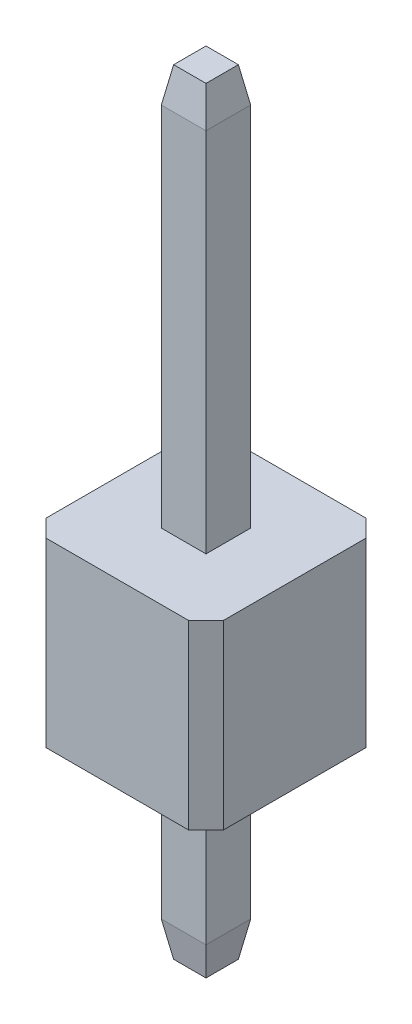
ISO-10303-21;
HEADER;
FILE_DESCRIPTION(('STEP AP214'),'2;1');
FILE_NAME('part.step','',(''),(''),'','','');
FILE_SCHEMA(('AUTOMOTIVE_DESIGN { 1 0 10303 214 1 1 1 1 }'));
ENDSEC;
DATA;
#1=APPLICATION_CONTEXT('core data for automotive mechanical design processes');
#2=APPLICATION_PROTOCOL_DEFINITION('international standard','automotive_design',2000,#1);
#3=PRODUCT_CONTEXT('',#1,'mechanical');
#4=PRODUCT('Part','Part','',(#3));
#5=PRODUCT_RELATED_PRODUCT_CATEGORY('part','',(#4));
#6=PRODUCT_DEFINITION_FORMATION('','',#4);
#7=PRODUCT_DEFINITION_CONTEXT('part definition',#1,'design');
#8=PRODUCT_DEFINITION('design','',#6,#7);
#9=PRODUCT_DEFINITION_SHAPE('','',#8);
#10=(LENGTH_UNIT() NAMED_UNIT(*) SI_UNIT(.MILLI.,.METRE.));
#11=(NAMED_UNIT(*) PLANE_ANGLE_UNIT() SI_UNIT($,.RADIAN.));
#12=(NAMED_UNIT(*) SI_UNIT($,.STERADIAN.) SOLID_ANGLE_UNIT());
#13=UNCERTAINTY_MEASURE_WITH_UNIT(LENGTH_MEASURE(1.E-05),#10,'distance_accuracy_value','');
#14=(GEOMETRIC_REPRESENTATION_CONTEXT(3) GLOBAL_UNCERTAINTY_ASSIGNED_CONTEXT((#13)) GLOBAL_UNIT_ASSIGNED_CONTEXT((#10,
#11,#12)) REPRESENTATION_CONTEXT('',''));
#15=CARTESIAN_POINT('',(0.,0.,0.));
#16=DIRECTION('',(0.,0.,1.));
#17=DIRECTION('',(1.,0.,0.));
#18=AXIS2_PLACEMENT_3D('',#15,#16,#17);
#19=CARTESIAN_POINT('',(0.,2.6,1.27));
#20=DIRECTION('',(0.,0.,-1.));
#21=DIRECTION('',(-1.,0.,0.));
#22=AXIS2_PLACEMENT_3D('',#19,#20,#21);
#23=PLANE('',#22);
#24=DIRECTION('',(1.,0.,0.));
#25=VECTOR('',#24,1.);
#26=CARTESIAN_POINT('',(0.,2.6,1.27));
#27=LINE('',#26,#25);
#28=CARTESIAN_POINT('',(-1.02,2.6,1.27));
#29=VERTEX_POINT('',#28);
#30=CARTESIAN_POINT('',(1.02,2.6,1.27));
#31=VERTEX_POINT('',#30);
#32=EDGE_CURVE('E205',#29,#31,#27,.T.);
#33=ORIENTED_EDGE('',*,*,#32,.F.);
#34=DIRECTION('',(0.,-1.,0.));
#35=VECTOR('',#34,1.);
#36=CARTESIAN_POINT('',(-1.02,0.,1.27));
#37=LINE('',#36,#35);
#38=CARTESIAN_POINT('',(-1.02,0.,1.27));
#39=VERTEX_POINT('',#38);
#40=EDGE_CURVE('E261',#29,#39,#37,.T.);
#41=ORIENTED_EDGE('',*,*,#40,.T.);
#42=DIRECTION('',(1.,0.,0.));
#43=VECTOR('',#42,1.);
#44=CARTESIAN_POINT('',(0.,0.,1.27));
#45=LINE('',#44,#43);
#46=CARTESIAN_POINT('',(1.02,0.,1.27));
#47=VERTEX_POINT('',#46);
#48=EDGE_CURVE('E204',#39,#47,#45,.T.);
#49=ORIENTED_EDGE('',*,*,#48,.T.);
#50=DIRECTION('',(0.,1.,0.));
#51=VECTOR('',#50,1.);
#52=CARTESIAN_POINT('',(1.02,2.6,1.27));
#53=LINE('',#52,#51);
#54=EDGE_CURVE('E259',#47,#31,#53,.T.);
#55=ORIENTED_EDGE('',*,*,#54,.T.);
#56=EDGE_LOOP('',(#33,#41,#49,#55));
#57=FACE_BOUND('',#56,.T.);
#58=ADVANCED_FACE('F17',(#57),#23,.F.);
#59=CARTESIAN_POINT('',(1.27,2.6,0.));
#60=DIRECTION('',(-1.,0.,0.));
#61=DIRECTION('',(0.,0.,1.));
#62=AXIS2_PLACEMENT_3D('',#59,#60,#61);
#63=PLANE('',#62);
#64=DIRECTION('',(0.,0.,-1.));
#65=VECTOR('',#64,1.);
#66=CARTESIAN_POINT('',(1.27,0.,0.));
#67=LINE('',#66,#65);
#68=CARTESIAN_POINT('',(1.27,0.,1.02));
#69=VERTEX_POINT('',#68);
#70=CARTESIAN_POINT('',(1.27,0.,-1.02));
#71=VERTEX_POINT('',#70);
#72=EDGE_CURVE('E221',#69,#71,#67,.T.);
#73=ORIENTED_EDGE('',*,*,#72,.T.);
#74=DIRECTION('',(0.,1.,0.));
#75=VECTOR('',#74,1.);
#76=CARTESIAN_POINT('',(1.27,2.6,-1.02));
#77=LINE('',#76,#75);
#78=CARTESIAN_POINT('',(1.27,2.6,-1.02));
#79=VERTEX_POINT('',#78);
#80=EDGE_CURVE('E244',#71,#79,#77,.T.);
#81=ORIENTED_EDGE('',*,*,#80,.T.);
#82=DIRECTION('',(0.,0.,-1.));
#83=VECTOR('',#82,1.);
#84=CARTESIAN_POINT('',(1.27,2.6,0.));
#85=LINE('',#84,#83);
#86=CARTESIAN_POINT('',(1.27,2.6,1.02));
#87=VERTEX_POINT('',#86);
#88=EDGE_CURVE('E208',#87,#79,#85,.T.);
#89=ORIENTED_EDGE('',*,*,#88,.F.);
#90=DIRECTION('',(0.,-1.,0.));
#91=VECTOR('',#90,1.);
#92=CARTESIAN_POINT('',(1.27,2.6,1.02));
#93=LINE('',#92,#91);
#94=EDGE_CURVE('E241',#87,#69,#93,.T.);
#95=ORIENTED_EDGE('',*,*,#94,.T.);
#96=EDGE_LOOP('',(#73,#81,#89,#95));
#97=FACE_BOUND('',#96,.T.);
#98=ADVANCED_FACE('F383',(#97),#63,.F.);
#99=CARTESIAN_POINT('',(0.,2.6,-1.27));
#100=DIRECTION('',(0.,0.,-1.));
#101=DIRECTION('',(-1.,0.,0.));
#102=AXIS2_PLACEMENT_3D('',#99,#100,#101);
#103=PLANE('',#102);
#104=DIRECTION('',(1.,0.,0.));
#105=VECTOR('',#104,1.);
#106=CARTESIAN_POINT('',(0.,2.6,-1.27));
#107=LINE('',#106,#105);
#108=CARTESIAN_POINT('',(-1.02,2.6,-1.27));
#109=VERTEX_POINT('',#108);
#110=CARTESIAN_POINT('',(1.02,2.6,-1.27));
#111=VERTEX_POINT('',#110);
#112=EDGE_CURVE('E212',#109,#111,#107,.T.);
#113=ORIENTED_EDGE('',*,*,#112,.T.);
#114=DIRECTION('',(0.,-1.,0.));
#115=VECTOR('',#114,1.);
#116=CARTESIAN_POINT('',(1.02,0.,-1.27));
#117=LINE('',#116,#115);
#118=CARTESIAN_POINT('',(1.02,0.,-1.27));
#119=VERTEX_POINT('',#118);
#120=EDGE_CURVE('E230',#111,#119,#117,.T.);
#121=ORIENTED_EDGE('',*,*,#120,.T.);
#122=DIRECTION('',(1.,0.,0.));
#123=VECTOR('',#122,1.);
#124=CARTESIAN_POINT('',(0.,0.,-1.27));
#125=LINE('',#124,#123);
#126=CARTESIAN_POINT('',(-1.02,0.,-1.27));
#127=VERTEX_POINT('',#126);
#128=EDGE_CURVE('E224',#127,#119,#125,.T.);
#129=ORIENTED_EDGE('',*,*,#128,.F.);
#130=DIRECTION('',(0.,1.,0.));
#131=VECTOR('',#130,1.);
#132=CARTESIAN_POINT('',(-1.02,2.6,-1.27));
#133=LINE('',#132,#131);
#134=EDGE_CURVE('E218',#127,#109,#133,.T.);
#135=ORIENTED_EDGE('',*,*,#134,.T.);
#136=EDGE_LOOP('',(#113,#121,#129,#135));
#137=FACE_BOUND('',#136,.T.);
#138=ADVANCED_FACE('F389',(#137),#103,.T.);
#139=CARTESIAN_POINT('',(-1.27,2.6,0.));
#140=DIRECTION('',(-1.,0.,0.));
#141=DIRECTION('',(0.,0.,1.));
#142=AXIS2_PLACEMENT_3D('',#139,#140,#141);
#143=PLANE('',#142);
#144=DIRECTION('',(0.,0.,-1.));
#145=VECTOR('',#144,1.);
#146=CARTESIAN_POINT('',(-1.27,2.6,0.));
#147=LINE('',#146,#145);
#148=CARTESIAN_POINT('',(-1.27,2.6,1.02));
#149=VERTEX_POINT('',#148);
#150=CARTESIAN_POINT('',(-1.27,2.6,-1.02));
#151=VERTEX_POINT('',#150);
#152=EDGE_CURVE('E215',#149,#151,#147,.T.);
#153=ORIENTED_EDGE('',*,*,#152,.T.);
#154=DIRECTION('',(0.,-1.,0.));
#155=VECTOR('',#154,1.);
#156=CARTESIAN_POINT('',(-1.27,2.6,-1.02));
#157=LINE('',#156,#155);
#158=CARTESIAN_POINT('',(-1.27,0.,-1.02));
#159=VERTEX_POINT('',#158);
#160=EDGE_CURVE('E256',#151,#159,#157,.T.);
#161=ORIENTED_EDGE('',*,*,#160,.T.);
#162=DIRECTION('',(0.,0.,-1.));
#163=VECTOR('',#162,1.);
#164=CARTESIAN_POINT('',(-1.27,0.,0.));
#165=LINE('',#164,#163);
#166=CARTESIAN_POINT('',(-1.27,0.,1.02));
#167=VERTEX_POINT('',#166);
#168=EDGE_CURVE('E209',#167,#159,#165,.T.);
#169=ORIENTED_EDGE('',*,*,#168,.F.);
#170=DIRECTION('',(0.,1.,0.));
#171=VECTOR('',#170,1.);
#172=CARTESIAN_POINT('',(-1.27,2.6,1.02));
#173=LINE('',#172,#171);
#174=EDGE_CURVE('E254',#167,#149,#173,.T.);
#175=ORIENTED_EDGE('',*,*,#174,.T.);
#176=EDGE_LOOP('',(#153,#161,#169,#175));
#177=FACE_BOUND('',#176,.T.);
#178=ADVANCED_FACE('F429',(#177),#143,.T.);
#179=CARTESIAN_POINT('',(0.,2.6,0.));
#180=DIRECTION('',(0.,1.,0.));
#181=DIRECTION('',(0.,0.,1.));
#182=AXIS2_PLACEMENT_3D('',#179,#180,#181);
#183=PLANE('',#182);
#184=DIRECTION('',(1.,0.,0.));
#185=VECTOR('',#184,1.);
#186=CARTESIAN_POINT('',(0.,2.6,0.32));
#187=LINE('',#186,#185);
#188=CARTESIAN_POINT('',(-0.32,2.6,0.32));
#189=VERTEX_POINT('',#188);
#190=CARTESIAN_POINT('',(0.32,2.6,0.32));
#191=VERTEX_POINT('',#190);
#192=EDGE_CURVE('E32',#189,#191,#187,.T.);
#193=ORIENTED_EDGE('',*,*,#192,.F.);
#194=DIRECTION('',(0.,0.,-1.));
#195=VECTOR('',#194,1.);
#196=CARTESIAN_POINT('',(-0.32,2.6,0.));
#197=LINE('',#196,#195);
#198=CARTESIAN_POINT('',(-0.32,2.6,-0.32));
#199=VERTEX_POINT('',#198);
#200=EDGE_CURVE('E36',#189,#199,#197,.T.);
#201=ORIENTED_EDGE('',*,*,#200,.T.);
#202=DIRECTION('',(1.,0.,0.));
#203=VECTOR('',#202,1.);
#204=CARTESIAN_POINT('',(0.,2.6,-0.32));
#205=LINE('',#204,#203);
#206=CARTESIAN_POINT('',(0.32,2.6,-0.32));
#207=VERTEX_POINT('',#206);
#208=EDGE_CURVE('E199',#199,#207,#205,.T.);
#209=ORIENTED_EDGE('',*,*,#208,.T.);
#210=DIRECTION('',(0.,0.,-1.));
#211=VECTOR('',#210,1.);
#212=CARTESIAN_POINT('',(0.32,2.6,0.));
#213=LINE('',#212,#211);
#214=EDGE_CURVE('E196',#191,#207,#213,.T.);
#215=ORIENTED_EDGE('',*,*,#214,.F.);
#216=EDGE_LOOP('',(#193,#201,#209,#215));
#217=FACE_BOUND('',#216,.T.);
#218=ORIENTED_EDGE('',*,*,#88,.T.);
#219=DIRECTION('',(-0.707106781186546,0.,-0.707106781186549));
#220=VECTOR('',#219,1.);
#221=CARTESIAN_POINT('',(1.145,2.6,-1.145));
#222=LINE('',#221,#220);
#223=EDGE_CURVE('E252',#79,#111,#222,.T.);
#224=ORIENTED_EDGE('',*,*,#223,.T.);
#225=ORIENTED_EDGE('',*,*,#112,.F.);
#226=DIRECTION('',(0.707106781186549,0.,-0.707106781186546));
#227=VECTOR('',#226,1.);
#228=CARTESIAN_POINT('',(-1.145,2.6,-1.145));
#229=LINE('',#228,#227);
#230=EDGE_CURVE('E250',#109,#151,#229,.F.);
#231=ORIENTED_EDGE('',*,*,#230,.T.);
#232=ORIENTED_EDGE('',*,*,#152,.F.);
#233=DIRECTION('',(0.707106781186546,0.,0.707106781186549));
#234=VECTOR('',#233,1.);
#235=CARTESIAN_POINT('',(-1.145,2.6,1.145));
#236=LINE('',#235,#234);
#237=EDGE_CURVE('E248',#149,#29,#236,.T.);
#238=ORIENTED_EDGE('',*,*,#237,.T.);
#239=ORIENTED_EDGE('',*,*,#32,.T.);
#240=DIRECTION('',(-0.707106781186549,0.,0.707106781186546));
#241=VECTOR('',#240,1.);
#242=CARTESIAN_POINT('',(1.145,2.6,1.145));
#243=LINE('',#242,#241);
#244=EDGE_CURVE('E246',#31,#87,#243,.F.);
#245=ORIENTED_EDGE('',*,*,#244,.T.);
#246=EDGE_LOOP('',(#218,#224,#225,#231,#232,#238,#239,#245));
#247=FACE_BOUND('',#246,.T.);
#248=ADVANCED_FACE('F363',(#217,#247),#183,.T.);
#249=CARTESIAN_POINT('',(0.,0.,0.));
#250=DIRECTION('',(0.,1.,0.));
#251=DIRECTION('',(0.,0.,1.));
#252=AXIS2_PLACEMENT_3D('',#249,#250,#251);
#253=PLANE('',#252);
#254=DIRECTION('',(0.,0.,-1.));
#255=VECTOR('',#254,1.);
#256=CARTESIAN_POINT('',(-0.32,0.,0.));
#257=LINE('',#256,#255);
#258=CARTESIAN_POINT('',(-0.32,0.,0.32));
#259=VERTEX_POINT('',#258);
#260=CARTESIAN_POINT('',(-0.32,0.,-0.32));
#261=VERTEX_POINT('',#260);
#262=EDGE_CURVE('E25',#259,#261,#257,.T.);
#263=ORIENTED_EDGE('',*,*,#262,.F.);
#264=DIRECTION('',(1.,0.,0.));
#265=VECTOR('',#264,1.);
#266=CARTESIAN_POINT('',(0.,0.,0.32));
#267=LINE('',#266,#265);
#268=CARTESIAN_POINT('',(0.32,0.,0.32));
#269=VERTEX_POINT('',#268);
#270=EDGE_CURVE('E11',#259,#269,#267,.T.);
#271=ORIENTED_EDGE('',*,*,#270,.T.);
#272=DIRECTION('',(0.,0.,-1.));
#273=VECTOR('',#272,1.);
#274=CARTESIAN_POINT('',(0.32,0.,0.));
#275=LINE('',#274,#273);
#276=CARTESIAN_POINT('',(0.32,0.,-0.32));
#277=VERTEX_POINT('',#276);
#278=EDGE_CURVE('E264',#269,#277,#275,.T.);
#279=ORIENTED_EDGE('',*,*,#278,.T.);
#280=DIRECTION('',(1.,0.,0.));
#281=VECTOR('',#280,1.);
#282=CARTESIAN_POINT('',(0.,0.,-0.32));
#283=LINE('',#282,#281);
#284=EDGE_CURVE('E267',#261,#277,#283,.T.);
#285=ORIENTED_EDGE('',*,*,#284,.F.);
#286=EDGE_LOOP('',(#263,#271,#279,#285));
#287=FACE_BOUND('',#286,.T.);
#288=ORIENTED_EDGE('',*,*,#128,.T.);
#289=DIRECTION('',(0.707106781186546,0.,0.707106781186549));
#290=VECTOR('',#289,1.);
#291=CARTESIAN_POINT('',(1.02,0.,-1.27));
#292=LINE('',#291,#290);
#293=EDGE_CURVE('E239',#119,#71,#292,.T.);
#294=ORIENTED_EDGE('',*,*,#293,.T.);
#295=ORIENTED_EDGE('',*,*,#72,.F.);
#296=DIRECTION('',(0.707106781186549,0.,-0.707106781186546));
#297=VECTOR('',#296,1.);
#298=CARTESIAN_POINT('',(1.27,0.,1.02));
#299=LINE('',#298,#297);
#300=EDGE_CURVE('E233',#69,#47,#299,.F.);
#301=ORIENTED_EDGE('',*,*,#300,.T.);
#302=ORIENTED_EDGE('',*,*,#48,.F.);
#303=DIRECTION('',(-0.707106781186546,0.,-0.707106781186549));
#304=VECTOR('',#303,1.);
#305=CARTESIAN_POINT('',(-1.02,0.,1.27));
#306=LINE('',#305,#304);
#307=EDGE_CURVE('E235',#39,#167,#306,.T.);
#308=ORIENTED_EDGE('',*,*,#307,.T.);
#309=ORIENTED_EDGE('',*,*,#168,.T.);
#310=DIRECTION('',(-0.707106781186549,0.,0.707106781186546));
#311=VECTOR('',#310,1.);
#312=CARTESIAN_POINT('',(-1.27,0.,-1.02));
#313=LINE('',#312,#311);
#314=EDGE_CURVE('E237',#159,#127,#313,.F.);
#315=ORIENTED_EDGE('',*,*,#314,.T.);
#316=EDGE_LOOP('',(#288,#294,#295,#301,#302,#308,#309,#315));
#317=FACE_BOUND('',#316,.T.);
#318=ADVANCED_FACE('F288',(#287,#317),#253,.F.);
#319=CARTESIAN_POINT('',(1.02,2.6,-1.27));
#320=DIRECTION('',(0.707106781186549,0.,-0.707106781186546));
#321=DIRECTION('',(0.,1.,0.));
#322=AXIS2_PLACEMENT_3D('',#319,#320,#321);
#323=PLANE('',#322);
#324=ORIENTED_EDGE('',*,*,#223,.F.);
#325=ORIENTED_EDGE('',*,*,#80,.F.);
#326=ORIENTED_EDGE('',*,*,#293,.F.);
#327=ORIENTED_EDGE('',*,*,#120,.F.);
#328=EDGE_LOOP('',(#324,#325,#326,#327));
#329=FACE_BOUND('',#328,.T.);
#330=ADVANCED_FACE('F395',(#329),#323,.T.);
#331=CARTESIAN_POINT('',(-1.27,2.6,-1.02));
#332=DIRECTION('',(0.707106781186546,0.,0.707106781186549));
#333=DIRECTION('',(0.,-1.,0.));
#334=AXIS2_PLACEMENT_3D('',#331,#332,#333);
#335=PLANE('',#334);
#336=ORIENTED_EDGE('',*,*,#230,.F.);
#337=ORIENTED_EDGE('',*,*,#134,.F.);
#338=ORIENTED_EDGE('',*,*,#314,.F.);
#339=ORIENTED_EDGE('',*,*,#160,.F.);
#340=EDGE_LOOP('',(#336,#337,#338,#339));
#341=FACE_BOUND('',#340,.T.);
#342=ADVANCED_FACE('F398',(#341),#335,.F.);
#343=CARTESIAN_POINT('',(-1.02,2.6,1.27));
#344=DIRECTION('',(-0.707106781186549,0.,0.707106781186546));
#345=DIRECTION('',(0.,1.,0.));
#346=AXIS2_PLACEMENT_3D('',#343,#344,#345);
#347=PLANE('',#346);
#348=ORIENTED_EDGE('',*,*,#237,.F.);
#349=ORIENTED_EDGE('',*,*,#174,.F.);
#350=ORIENTED_EDGE('',*,*,#307,.F.);
#351=ORIENTED_EDGE('',*,*,#40,.F.);
#352=EDGE_LOOP('',(#348,#349,#350,#351));
#353=FACE_BOUND('',#352,.T.);
#354=ADVANCED_FACE('F401',(#353),#347,.T.);
#355=CARTESIAN_POINT('',(1.27,2.6,1.02));
#356=DIRECTION('',(-0.707106781186546,0.,-0.707106781186549));
#357=DIRECTION('',(0.,-1.,0.));
#358=AXIS2_PLACEMENT_3D('',#355,#356,#357);
#359=PLANE('',#358);
#360=ORIENTED_EDGE('',*,*,#244,.F.);
#361=ORIENTED_EDGE('',*,*,#54,.F.);
#362=ORIENTED_EDGE('',*,*,#300,.F.);
#363=ORIENTED_EDGE('',*,*,#94,.F.);
#364=EDGE_LOOP('',(#360,#361,#362,#363));
#365=FACE_BOUND('',#364,.T.);
#366=ADVANCED_FACE('F19',(#365),#359,.F.);
#367=CARTESIAN_POINT('',(0.,-2.75,0.));
#368=DIRECTION('',(0.,1.,0.));
#369=DIRECTION('',(0.,0.,1.));
#370=AXIS2_PLACEMENT_3D('',#367,#368,#369);
#371=PLANE('',#370);
#372=DIRECTION('',(0.,0.,-1.));
#373=VECTOR('',#372,1.);
#374=CARTESIAN_POINT('',(-0.231836509645768,-2.75,0.));
#375=LINE('',#374,#373);
#376=CARTESIAN_POINT('',(-0.231836509645768,-2.75,0.231836509645769));
#377=VERTEX_POINT('',#376);
#378=CARTESIAN_POINT('',(-0.231836509645768,-2.75,-0.231836509645766));
#379=VERTEX_POINT('',#378);
#380=EDGE_CURVE('E162',#377,#379,#375,.T.);
#381=ORIENTED_EDGE('',*,*,#380,.T.);
#382=DIRECTION('',(1.,0.,0.));
#383=VECTOR('',#382,1.);
#384=CARTESIAN_POINT('',(0.,-2.75,-0.231836509645766));
#385=LINE('',#384,#383);
#386=CARTESIAN_POINT('',(0.231836509645768,-2.75,-0.231836509645766));
#387=VERTEX_POINT('',#386);
#388=EDGE_CURVE('E158',#379,#387,#385,.T.);
#389=ORIENTED_EDGE('',*,*,#388,.T.);
#390=DIRECTION('',(0.,0.,1.));
#391=VECTOR('',#390,1.);
#392=CARTESIAN_POINT('',(0.231836509645768,-2.75,0.32));
#393=LINE('',#392,#391);
#394=CARTESIAN_POINT('',(0.231836509645768,-2.75,0.231836509645769));
#395=VERTEX_POINT('',#394);
#396=EDGE_CURVE('E152',#387,#395,#393,.T.);
#397=ORIENTED_EDGE('',*,*,#396,.T.);
#398=DIRECTION('',(-1.,0.,0.));
#399=VECTOR('',#398,1.);
#400=CARTESIAN_POINT('',(-0.32,-2.75,0.231836509645769));
#401=LINE('',#400,#399);
#402=EDGE_CURVE('E155',#395,#377,#401,.T.);
#403=ORIENTED_EDGE('',*,*,#402,.T.);
#404=EDGE_LOOP('',(#381,#389,#397,#403));
#405=FACE_BOUND('',#404,.T.);
#406=ADVANCED_FACE('F154',(#405),#371,.F.);
#407=CARTESIAN_POINT('',(-0.32,-2.25,0.32));
#408=DIRECTION('',(0.,-0.173648177666927,0.984807753012209));
#409=DIRECTION('',(-1.,0.,0.));
#410=AXIS2_PLACEMENT_3D('',#407,#408,#409);
#411=PLANE('',#410);
#412=DIRECTION('',(0.171087869746033,0.970287525247815,0.171087869746033));
#413=VECTOR('',#412,1.);
#414=CARTESIAN_POINT('',(0.301266522128489,-2.35624283247091,0.30126652212849));
#415=LINE('',#414,#413);
#416=CARTESIAN_POINT('',(0.32,-2.25,0.32));
#417=VERTEX_POINT('',#416);
#418=EDGE_CURVE('E168',#417,#395,#415,.F.);
#419=ORIENTED_EDGE('',*,*,#418,.F.);
#420=DIRECTION('',(1.,0.,0.));
#421=VECTOR('',#420,1.);
#422=CARTESIAN_POINT('',(0.32,-2.25,0.32));
#423=LINE('',#422,#421);
#424=CARTESIAN_POINT('',(-0.32,-2.25,0.32));
#425=VERTEX_POINT('',#424);
#426=EDGE_CURVE('E298',#425,#417,#423,.T.);
#427=ORIENTED_EDGE('',*,*,#426,.F.);
#428=DIRECTION('',(-0.171087869746033,0.970287525247815,0.171087869746033));
#429=VECTOR('',#428,1.);
#430=CARTESIAN_POINT('',(-0.32,-2.25,0.32));
#431=LINE('',#430,#429);
#432=EDGE_CURVE('E171',#377,#425,#431,.T.);
#433=ORIENTED_EDGE('',*,*,#432,.F.);
#434=ORIENTED_EDGE('',*,*,#402,.F.);
#435=EDGE_LOOP('',(#419,#427,#433,#434));
#436=FACE_BOUND('',#435,.T.);
#437=ADVANCED_FACE('F166',(#436),#411,.T.);
#438=CARTESIAN_POINT('',(-0.231836509645768,-2.75,0.));
#439=DIRECTION('',(0.984807753012209,0.173648177666927,0.));
#440=DIRECTION('',(0.,0.,-1.));
#441=AXIS2_PLACEMENT_3D('',#438,#439,#440);
#442=PLANE('',#441);
#443=ORIENTED_EDGE('',*,*,#432,.T.);
#444=DIRECTION('',(0.,0.,1.));
#445=VECTOR('',#444,1.);
#446=CARTESIAN_POINT('',(-0.32,-2.25,0.32));
#447=LINE('',#446,#445);
#448=CARTESIAN_POINT('',(-0.32,-2.25,-0.32));
#449=VERTEX_POINT('',#448);
#450=EDGE_CURVE('E316',#449,#425,#447,.T.);
#451=ORIENTED_EDGE('',*,*,#450,.F.);
#452=DIRECTION('',(0.171087869746033,-0.970287525247815,0.171087869746033));
#453=VECTOR('',#452,1.);
#454=CARTESIAN_POINT('',(-0.225050409453179,-2.78848588664833,-0.225050409453178));
#455=LINE('',#454,#453);
#456=EDGE_CURVE('E177',#379,#449,#455,.F.);
#457=ORIENTED_EDGE('',*,*,#456,.F.);
#458=ORIENTED_EDGE('',*,*,#380,.F.);
#459=EDGE_LOOP('',(#443,#451,#457,#458));
#460=FACE_BOUND('',#459,.T.);
#461=ADVANCED_FACE('F334',(#460),#442,.F.);
#462=CARTESIAN_POINT('',(0.,-2.75,-0.231836509645766));
#463=DIRECTION('',(0.,0.173648177666927,0.984807753012209));
#464=DIRECTION('',(1.,0.,0.));
#465=AXIS2_PLACEMENT_3D('',#462,#463,#464);
#466=PLANE('',#465);
#467=ORIENTED_EDGE('',*,*,#456,.T.);
#468=DIRECTION('',(-1.,0.,0.));
#469=VECTOR('',#468,1.);
#470=CARTESIAN_POINT('',(-0.32,-2.25,-0.32));
#471=LINE('',#470,#469);
#472=CARTESIAN_POINT('',(0.32,-2.25,-0.32));
#473=VERTEX_POINT('',#472);
#474=EDGE_CURVE('E284',#473,#449,#471,.T.);
#475=ORIENTED_EDGE('',*,*,#474,.F.);
#476=DIRECTION('',(-0.171087869746033,-0.970287525247815,0.171087869746033));
#477=VECTOR('',#476,1.);
#478=CARTESIAN_POINT('',(0.301266522128489,-2.35624283247091,-0.301266522128488));
#479=LINE('',#478,#477);
#480=EDGE_CURVE('E181',#473,#387,#479,.T.);
#481=ORIENTED_EDGE('',*,*,#480,.T.);
#482=ORIENTED_EDGE('',*,*,#388,.F.);
#483=EDGE_LOOP('',(#467,#475,#481,#482));
#484=FACE_BOUND('',#483,.T.);
#485=ADVANCED_FACE('F330',(#484),#466,.F.);
#486=CARTESIAN_POINT('',(0.32,-2.25,0.32));
#487=DIRECTION('',(0.984807753012209,-0.173648177666927,0.));
#488=DIRECTION('',(0.,0.,1.));
#489=AXIS2_PLACEMENT_3D('',#486,#487,#488);
#490=PLANE('',#489);
#491=ORIENTED_EDGE('',*,*,#418,.T.);
#492=ORIENTED_EDGE('',*,*,#396,.F.);
#493=ORIENTED_EDGE('',*,*,#480,.F.);
#494=DIRECTION('',(0.,0.,-1.));
#495=VECTOR('',#494,1.);
#496=CARTESIAN_POINT('',(0.32,-2.25,-0.32));
#497=LINE('',#496,#495);
#498=EDGE_CURVE('E176',#417,#473,#497,.T.);
#499=ORIENTED_EDGE('',*,*,#498,.F.);
#500=EDGE_LOOP('',(#491,#492,#493,#499));
#501=FACE_BOUND('',#500,.T.);
#502=ADVANCED_FACE('F175',(#501),#490,.T.);
#503=CARTESIAN_POINT('',(0.32,-2.75,0.32));
#504=DIRECTION('',(1.,0.,0.));
#505=DIRECTION('',(0.,0.,-1.));
#506=AXIS2_PLACEMENT_3D('',#503,#504,#505);
#507=PLANE('',#506);
#508=ORIENTED_EDGE('',*,*,#278,.F.);
#509=DIRECTION('',(0.,1.,0.));
#510=VECTOR('',#509,1.);
#511=CARTESIAN_POINT('',(0.32,-2.75,0.32));
#512=LINE('',#511,#510);
#513=EDGE_CURVE('E294',#417,#269,#512,.T.);
#514=ORIENTED_EDGE('',*,*,#513,.F.);
#515=ORIENTED_EDGE('',*,*,#498,.T.);
#516=DIRECTION('',(0.,1.,0.));
#517=VECTOR('',#516,1.);
#518=CARTESIAN_POINT('',(0.32,-2.75,-0.32));
#519=LINE('',#518,#517);
#520=EDGE_CURVE('E295',#473,#277,#519,.T.);
#521=ORIENTED_EDGE('',*,*,#520,.T.);
#522=EDGE_LOOP('',(#508,#514,#515,#521));
#523=FACE_BOUND('',#522,.T.);
#524=ADVANCED_FACE('F293',(#523),#507,.T.);
#525=CARTESIAN_POINT('',(-0.32,-2.75,-0.32));
#526=DIRECTION('',(0.,0.,1.));
#527=DIRECTION('',(1.,0.,0.));
#528=AXIS2_PLACEMENT_3D('',#525,#526,#527);
#529=PLANE('',#528);
#530=DIRECTION('',(0.,1.,0.));
#531=VECTOR('',#530,1.);
#532=CARTESIAN_POINT('',(-0.32,-2.75,-0.32));
#533=LINE('',#532,#531);
#534=EDGE_CURVE('E275',#449,#261,#533,.T.);
#535=ORIENTED_EDGE('',*,*,#534,.T.);
#536=ORIENTED_EDGE('',*,*,#284,.T.);
#537=ORIENTED_EDGE('',*,*,#520,.F.);
#538=ORIENTED_EDGE('',*,*,#474,.T.);
#539=EDGE_LOOP('',(#535,#536,#537,#538));
#540=FACE_BOUND('',#539,.T.);
#541=ADVANCED_FACE('F281',(#540),#529,.F.);
#542=CARTESIAN_POINT('',(-0.32,-2.75,0.32));
#543=DIRECTION('',(1.,0.,0.));
#544=DIRECTION('',(0.,0.,-1.));
#545=AXIS2_PLACEMENT_3D('',#542,#543,#544);
#546=PLANE('',#545);
#547=DIRECTION('',(0.,1.,0.));
#548=VECTOR('',#547,1.);
#549=CARTESIAN_POINT('',(-0.32,-2.75,0.32));
#550=LINE('',#549,#548);
#551=EDGE_CURVE('E173',#425,#259,#550,.T.);
#552=ORIENTED_EDGE('',*,*,#551,.T.);
#553=ORIENTED_EDGE('',*,*,#262,.T.);
#554=ORIENTED_EDGE('',*,*,#534,.F.);
#555=ORIENTED_EDGE('',*,*,#450,.T.);
#556=EDGE_LOOP('',(#552,#553,#554,#555));
#557=FACE_BOUND('',#556,.T.);
#558=ADVANCED_FACE('F274',(#557),#546,.F.);
#559=CARTESIAN_POINT('',(-0.32,-2.75,0.32));
#560=DIRECTION('',(0.,0.,1.));
#561=DIRECTION('',(1.,0.,0.));
#562=AXIS2_PLACEMENT_3D('',#559,#560,#561);
#563=PLANE('',#562);
#564=ORIENTED_EDGE('',*,*,#270,.F.);
#565=ORIENTED_EDGE('',*,*,#551,.F.);
#566=ORIENTED_EDGE('',*,*,#426,.T.);
#567=ORIENTED_EDGE('',*,*,#513,.T.);
#568=EDGE_LOOP('',(#564,#565,#566,#567));
#569=FACE_BOUND('',#568,.T.);
#570=ADVANCED_FACE('F297',(#569),#563,.T.);
#571=CARTESIAN_POINT('',(-0.32,7.85,0.32));
#572=VERTEX_POINT('',#571);
#573=EDGE_CURVE('E285',#189,#572,#550,.T.);
#574=ORIENTED_EDGE('',*,*,#573,.F.);
#575=ORIENTED_EDGE('',*,*,#192,.T.);
#576=CARTESIAN_POINT('',(0.32,7.85,0.32));
#577=VERTEX_POINT('',#576);
#578=EDGE_CURVE('E179',#191,#577,#512,.T.);
#579=ORIENTED_EDGE('',*,*,#578,.T.);
#580=DIRECTION('',(-1.,0.,0.));
#581=VECTOR('',#580,1.);
#582=CARTESIAN_POINT('',(-0.32,7.85,0.32));
#583=LINE('',#582,#581);
#584=EDGE_CURVE('E318',#577,#572,#583,.T.);
#585=ORIENTED_EDGE('',*,*,#584,.T.);
#586=EDGE_LOOP('',(#574,#575,#579,#585));
#587=FACE_BOUND('',#586,.T.);
#588=ADVANCED_FACE('F345',(#587),#563,.T.);
#589=ORIENTED_EDGE('',*,*,#200,.F.);
#590=ORIENTED_EDGE('',*,*,#573,.T.);
#591=DIRECTION('',(0.,0.,-1.));
#592=VECTOR('',#591,1.);
#593=CARTESIAN_POINT('',(-0.32,7.85,-0.32));
#594=LINE('',#593,#592);
#595=CARTESIAN_POINT('',(-0.32,7.85,-0.32));
#596=VERTEX_POINT('',#595);
#597=EDGE_CURVE('E313',#572,#596,#594,.T.);
#598=ORIENTED_EDGE('',*,*,#597,.T.);
#599=EDGE_CURVE('E286',#199,#596,#533,.T.);
#600=ORIENTED_EDGE('',*,*,#599,.F.);
#601=EDGE_LOOP('',(#589,#590,#598,#600));
#602=FACE_BOUND('',#601,.T.);
#603=ADVANCED_FACE('F338',(#602),#546,.F.);
#604=ORIENTED_EDGE('',*,*,#208,.F.);
#605=ORIENTED_EDGE('',*,*,#599,.T.);
#606=DIRECTION('',(1.,0.,0.));
#607=VECTOR('',#606,1.);
#608=CARTESIAN_POINT('',(0.32,7.85,-0.32));
#609=LINE('',#608,#607);
#610=CARTESIAN_POINT('',(0.32,7.85,-0.32));
#611=VERTEX_POINT('',#610);
#612=EDGE_CURVE('E305',#596,#611,#609,.T.);
#613=ORIENTED_EDGE('',*,*,#612,.T.);
#614=EDGE_CURVE('E299',#207,#611,#519,.T.);
#615=ORIENTED_EDGE('',*,*,#614,.F.);
#616=EDGE_LOOP('',(#604,#605,#613,#615));
#617=FACE_BOUND('',#616,.T.);
#618=ADVANCED_FACE('F362',(#617),#529,.F.);
#619=ORIENTED_EDGE('',*,*,#578,.F.);
#620=ORIENTED_EDGE('',*,*,#214,.T.);
#621=ORIENTED_EDGE('',*,*,#614,.T.);
#622=DIRECTION('',(0.,0.,1.));
#623=VECTOR('',#622,1.);
#624=CARTESIAN_POINT('',(0.32,7.85,0.32));
#625=LINE('',#624,#623);
#626=EDGE_CURVE('E309',#611,#577,#625,.T.);
#627=ORIENTED_EDGE('',*,*,#626,.T.);
#628=EDGE_LOOP('',(#619,#620,#621,#627));
#629=FACE_BOUND('',#628,.T.);
#630=ADVANCED_FACE('F366',(#629),#507,.T.);
#631=CARTESIAN_POINT('',(0.,8.35,0.));
#632=DIRECTION('',(0.,1.,0.));
#633=DIRECTION('',(0.,0.,1.));
#634=AXIS2_PLACEMENT_3D('',#631,#632,#633);
#635=PLANE('',#634);
#636=DIRECTION('',(0.,0.,-1.));
#637=VECTOR('',#636,1.);
#638=CARTESIAN_POINT('',(0.231836509645767,8.35,0.));
#639=LINE('',#638,#637);
#640=CARTESIAN_POINT('',(0.231836509645767,8.35,0.231836509645769));
#641=VERTEX_POINT('',#640);
#642=CARTESIAN_POINT('',(0.231836509645767,8.35,-0.231836509645766));
#643=VERTEX_POINT('',#642);
#644=EDGE_CURVE('E326',#641,#643,#639,.T.);
#645=ORIENTED_EDGE('',*,*,#644,.T.);
#646=DIRECTION('',(-1.,0.,0.));
#647=VECTOR('',#646,1.);
#648=CARTESIAN_POINT('',(-0.32,8.35,-0.231836509645766));
#649=LINE('',#648,#647);
#650=CARTESIAN_POINT('',(-0.231836509645767,8.35,-0.231836509645766));
#651=VERTEX_POINT('',#650);
#652=EDGE_CURVE('E200',#643,#651,#649,.T.);
#653=ORIENTED_EDGE('',*,*,#652,.T.);
#654=DIRECTION('',(0.,0.,1.));
#655=VECTOR('',#654,1.);
#656=CARTESIAN_POINT('',(-0.231836509645767,8.35,0.32));
#657=LINE('',#656,#655);
#658=CARTESIAN_POINT('',(-0.231836509645767,8.35,0.231836509645769));
#659=VERTEX_POINT('',#658);
#660=EDGE_CURVE('E324',#651,#659,#657,.T.);
#661=ORIENTED_EDGE('',*,*,#660,.T.);
#662=DIRECTION('',(1.,0.,0.));
#663=VECTOR('',#662,1.);
#664=CARTESIAN_POINT('',(0.,8.35,0.231836509645769));
#665=LINE('',#664,#663);
#666=EDGE_CURVE('E322',#659,#641,#665,.T.);
#667=ORIENTED_EDGE('',*,*,#666,.T.);
#668=EDGE_LOOP('',(#645,#653,#661,#667));
#669=FACE_BOUND('',#668,.T.);
#670=ADVANCED_FACE('F371',(#669),#635,.T.);
#671=CARTESIAN_POINT('',(0.,8.35,0.231836509645769));
#672=DIRECTION('',(0.,-0.173648177666928,-0.984807753012209));
#673=DIRECTION('',(1.,0.,0.));
#674=AXIS2_PLACEMENT_3D('',#671,#672,#673);
#675=PLANE('',#674);
#676=DIRECTION('',(-0.171087869746033,0.970287525247815,-0.171087869746033));
#677=VECTOR('',#676,1.);
#678=CARTESIAN_POINT('',(0.225050409453178,8.38848588664834,0.225050409453179));
#679=LINE('',#678,#677);
#680=EDGE_CURVE('E190',#641,#577,#679,.F.);
#681=ORIENTED_EDGE('',*,*,#680,.F.);
#682=ORIENTED_EDGE('',*,*,#666,.F.);
#683=DIRECTION('',(0.171087869746033,0.970287525247815,-0.171087869746033));
#684=VECTOR('',#683,1.);
#685=CARTESIAN_POINT('',(-0.225050409453178,8.38848588664834,0.22505040945318));
#686=LINE('',#685,#684);
#687=EDGE_CURVE('E193',#572,#659,#686,.T.);
#688=ORIENTED_EDGE('',*,*,#687,.F.);
#689=ORIENTED_EDGE('',*,*,#584,.F.);
#690=EDGE_LOOP('',(#681,#682,#688,#689));
#691=FACE_BOUND('',#690,.T.);
#692=ADVANCED_FACE('F350',(#691),#675,.F.);
#693=CARTESIAN_POINT('',(-0.32,7.85,0.32));
#694=DIRECTION('',(-0.984807753012209,0.173648177666928,0.));
#695=DIRECTION('',(0.,0.,1.));
#696=AXIS2_PLACEMENT_3D('',#693,#694,#695);
#697=PLANE('',#696);
#698=ORIENTED_EDGE('',*,*,#687,.T.);
#699=ORIENTED_EDGE('',*,*,#660,.F.);
#700=DIRECTION('',(-0.171087869746033,-0.970287525247815,-0.171087869746033));
#701=VECTOR('',#700,1.);
#702=CARTESIAN_POINT('',(-0.301266522128489,7.9562428324709,-0.301266522128488));
#703=LINE('',#702,#701);
#704=EDGE_CURVE('E188',#596,#651,#703,.F.);
#705=ORIENTED_EDGE('',*,*,#704,.F.);
#706=ORIENTED_EDGE('',*,*,#597,.F.);
#707=EDGE_LOOP('',(#698,#699,#705,#706));
#708=FACE_BOUND('',#707,.T.);
#709=ADVANCED_FACE('F353',(#708),#697,.T.);
#710=CARTESIAN_POINT('',(0.231836509645767,8.35,0.));
#711=DIRECTION('',(-0.984807753012209,-0.173648177666928,0.));
#712=DIRECTION('',(0.,0.,-1.));
#713=AXIS2_PLACEMENT_3D('',#710,#711,#712);
#714=PLANE('',#713);
#715=ORIENTED_EDGE('',*,*,#680,.T.);
#716=ORIENTED_EDGE('',*,*,#626,.F.);
#717=DIRECTION('',(0.171087869746033,-0.970287525247815,-0.171087869746033));
#718=VECTOR('',#717,1.);
#719=CARTESIAN_POINT('',(0.225050409453178,8.38848588664834,-0.225050409453177));
#720=LINE('',#719,#718);
#721=EDGE_CURVE('E185',#643,#611,#720,.T.);
#722=ORIENTED_EDGE('',*,*,#721,.F.);
#723=ORIENTED_EDGE('',*,*,#644,.F.);
#724=EDGE_LOOP('',(#715,#716,#722,#723));
#725=FACE_BOUND('',#724,.T.);
#726=ADVANCED_FACE('F368',(#725),#714,.F.);
#727=CARTESIAN_POINT('',(-0.32,7.85,-0.32));
#728=DIRECTION('',(0.,0.173648177666928,-0.984807753012209));
#729=DIRECTION('',(-1.,0.,0.));
#730=AXIS2_PLACEMENT_3D('',#727,#728,#729);
#731=PLANE('',#730);
#732=ORIENTED_EDGE('',*,*,#704,.T.);
#733=ORIENTED_EDGE('',*,*,#652,.F.);
#734=ORIENTED_EDGE('',*,*,#721,.T.);
#735=ORIENTED_EDGE('',*,*,#612,.F.);
#736=EDGE_LOOP('',(#732,#733,#734,#735));
#737=FACE_BOUND('',#736,.T.);
#738=ADVANCED_FACE('F357',(#737),#731,.T.);
#739=CLOSED_SHELL('',(#58,#98,#138,#178,#248,#318,#330,#342,#354,#366,#406,#437,#461,#485,#502,
#524,#541,#558,#570,#588,#603,#618,#630,#670,#692,#709,#726,#738));
#740=MANIFOLD_SOLID_BREP('B1',#739);
#741=ADVANCED_BREP_SHAPE_REPRESENTATION('',(#18,#740),#14);
#742=SHAPE_DEFINITION_REPRESENTATION(#9,#741);
ENDSEC;
END-ISO-10303-21;
